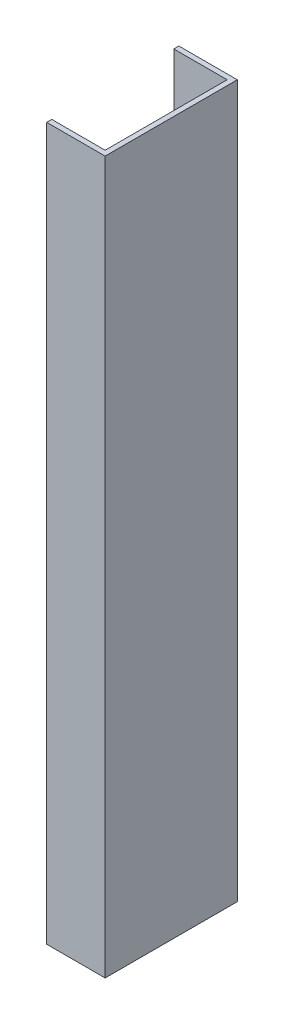
ISO-10303-21;
HEADER;
FILE_DESCRIPTION(('STEP AP214'),'2;1');
FILE_NAME('part.step','',(''),(''),'','','');
FILE_SCHEMA(('AUTOMOTIVE_DESIGN { 1 0 10303 214 1 1 1 1 }'));
ENDSEC;
DATA;
#1=APPLICATION_CONTEXT('core data for automotive mechanical design processes');
#2=APPLICATION_PROTOCOL_DEFINITION('international standard','automotive_design',2000,#1);
#3=PRODUCT_CONTEXT('',#1,'mechanical');
#4=PRODUCT('Part','Part','',(#3));
#5=PRODUCT_RELATED_PRODUCT_CATEGORY('part','',(#4));
#6=PRODUCT_DEFINITION_FORMATION('','',#4);
#7=PRODUCT_DEFINITION_CONTEXT('part definition',#1,'design');
#8=PRODUCT_DEFINITION('design','',#6,#7);
#9=PRODUCT_DEFINITION_SHAPE('','',#8);
#10=(LENGTH_UNIT() NAMED_UNIT(*) SI_UNIT(.MILLI.,.METRE.));
#11=(NAMED_UNIT(*) PLANE_ANGLE_UNIT() SI_UNIT($,.RADIAN.));
#12=(NAMED_UNIT(*) SI_UNIT($,.STERADIAN.) SOLID_ANGLE_UNIT());
#13=UNCERTAINTY_MEASURE_WITH_UNIT(LENGTH_MEASURE(1.E-05),#10,'distance_accuracy_value','');
#14=(GEOMETRIC_REPRESENTATION_CONTEXT(3) GLOBAL_UNCERTAINTY_ASSIGNED_CONTEXT((#13)) GLOBAL_UNIT_ASSIGNED_CONTEXT((#10,
#11,#12)) REPRESENTATION_CONTEXT('',''));
#15=CARTESIAN_POINT('',(0.,0.,0.));
#16=DIRECTION('',(0.,0.,1.));
#17=DIRECTION('',(1.,0.,0.));
#18=AXIS2_PLACEMENT_3D('',#15,#16,#17);
#19=CARTESIAN_POINT('',(-36.5125,222.25,38.1));
#20=DIRECTION('',(0.,0.,1.));
#21=DIRECTION('',(1.,0.,0.));
#22=AXIS2_PLACEMENT_3D('',#19,#20,#21);
#23=PLANE('',#22);
#24=DIRECTION('',(-1.,0.,0.));
#25=VECTOR('',#24,1.);
#26=CARTESIAN_POINT('',(-36.5125,-222.25,38.1));
#27=LINE('',#26,#25);
#28=CARTESIAN_POINT('',(-3.17499999999999,-222.25,38.1));
#29=VERTEX_POINT('',#28);
#30=CARTESIAN_POINT('',(-36.5125,-222.25,38.1));
#31=VERTEX_POINT('',#30);
#32=EDGE_CURVE('E144',#29,#31,#27,.T.);
#33=ORIENTED_EDGE('',*,*,#32,.T.);
#34=DIRECTION('',(0.,-1.,0.));
#35=VECTOR('',#34,1.);
#36=CARTESIAN_POINT('',(-36.5125,222.25,38.1));
#37=LINE('',#36,#35);
#38=CARTESIAN_POINT('',(-36.5125,222.25,38.1));
#39=VERTEX_POINT('',#38);
#40=EDGE_CURVE('E11',#39,#31,#37,.T.);
#41=ORIENTED_EDGE('',*,*,#40,.F.);
#42=DIRECTION('',(-1.,0.,0.));
#43=VECTOR('',#42,1.);
#44=CARTESIAN_POINT('',(-36.5125,222.25,38.1));
#45=LINE('',#44,#43);
#46=CARTESIAN_POINT('',(-3.17499999999999,222.25,38.1));
#47=VERTEX_POINT('',#46);
#48=EDGE_CURVE('E166',#47,#39,#45,.T.);
#49=ORIENTED_EDGE('',*,*,#48,.F.);
#50=DIRECTION('',(0.,-1.,0.));
#51=VECTOR('',#50,1.);
#52=CARTESIAN_POINT('',(-3.17499999999999,222.25,38.1));
#53=LINE('',#52,#51);
#54=EDGE_CURVE('E140',#47,#29,#53,.T.);
#55=ORIENTED_EDGE('',*,*,#54,.T.);
#56=EDGE_LOOP('',(#33,#41,#49,#55));
#57=FACE_BOUND('',#56,.T.);
#58=ADVANCED_FACE('F43',(#57),#23,.F.);
#59=CARTESIAN_POINT('',(-36.5125,222.25,41.275));
#60=DIRECTION('',(1.,0.,0.));
#61=DIRECTION('',(0.,0.,-1.));
#62=AXIS2_PLACEMENT_3D('',#59,#60,#61);
#63=PLANE('',#62);
#64=DIRECTION('',(0.,0.,1.));
#65=VECTOR('',#64,1.);
#66=CARTESIAN_POINT('',(-36.5125,-222.25,41.275));
#67=LINE('',#66,#65);
#68=CARTESIAN_POINT('',(-36.5125,-222.25,41.275));
#69=VERTEX_POINT('',#68);
#70=EDGE_CURVE('E148',#31,#69,#67,.T.);
#71=ORIENTED_EDGE('',*,*,#70,.T.);
#72=DIRECTION('',(0.,-1.,0.));
#73=VECTOR('',#72,1.);
#74=CARTESIAN_POINT('',(-36.5125,222.25,41.275));
#75=LINE('',#74,#73);
#76=CARTESIAN_POINT('',(-36.5125,222.25,41.275));
#77=VERTEX_POINT('',#76);
#78=EDGE_CURVE('E52',#77,#69,#75,.T.);
#79=ORIENTED_EDGE('',*,*,#78,.F.);
#80=DIRECTION('',(0.,0.,1.));
#81=VECTOR('',#80,1.);
#82=CARTESIAN_POINT('',(-36.5125,222.25,41.275));
#83=LINE('',#82,#81);
#84=EDGE_CURVE('E103',#39,#77,#83,.T.);
#85=ORIENTED_EDGE('',*,*,#84,.F.);
#86=ORIENTED_EDGE('',*,*,#40,.T.);
#87=EDGE_LOOP('',(#71,#79,#85,#86));
#88=FACE_BOUND('',#87,.T.);
#89=ADVANCED_FACE('F212',(#88),#63,.F.);
#90=CARTESIAN_POINT('',(0.,222.25,41.275));
#91=DIRECTION('',(0.,0.,-1.));
#92=DIRECTION('',(-1.,0.,0.));
#93=AXIS2_PLACEMENT_3D('',#90,#91,#92);
#94=PLANE('',#93);
#95=DIRECTION('',(1.,0.,0.));
#96=VECTOR('',#95,1.);
#97=CARTESIAN_POINT('',(0.,-222.25,41.275));
#98=LINE('',#97,#96);
#99=CARTESIAN_POINT('',(0.,-222.25,41.275));
#100=VERTEX_POINT('',#99);
#101=EDGE_CURVE('E151',#69,#100,#98,.T.);
#102=ORIENTED_EDGE('',*,*,#101,.T.);
#103=DIRECTION('',(0.,-1.,0.));
#104=VECTOR('',#103,1.);
#105=CARTESIAN_POINT('',(0.,222.25,41.275));
#106=LINE('',#105,#104);
#107=CARTESIAN_POINT('',(0.,222.25,41.275));
#108=VERTEX_POINT('',#107);
#109=EDGE_CURVE('E177',#108,#100,#106,.T.);
#110=ORIENTED_EDGE('',*,*,#109,.F.);
#111=DIRECTION('',(1.,0.,0.));
#112=VECTOR('',#111,1.);
#113=CARTESIAN_POINT('',(0.,222.25,41.275));
#114=LINE('',#113,#112);
#115=EDGE_CURVE('E187',#77,#108,#114,.T.);
#116=ORIENTED_EDGE('',*,*,#115,.F.);
#117=ORIENTED_EDGE('',*,*,#78,.T.);
#118=EDGE_LOOP('',(#102,#110,#116,#117));
#119=FACE_BOUND('',#118,.T.);
#120=ADVANCED_FACE('F185',(#119),#94,.F.);
#121=CARTESIAN_POINT('',(0.,222.25,-41.275));
#122=DIRECTION('',(-1.,0.,0.));
#123=DIRECTION('',(0.,0.,1.));
#124=AXIS2_PLACEMENT_3D('',#121,#122,#123);
#125=PLANE('',#124);
#126=DIRECTION('',(0.,0.,-1.));
#127=VECTOR('',#126,1.);
#128=CARTESIAN_POINT('',(0.,-222.25,-41.275));
#129=LINE('',#128,#127);
#130=CARTESIAN_POINT('',(0.,-222.25,-41.275));
#131=VERTEX_POINT('',#130);
#132=EDGE_CURVE('E154',#100,#131,#129,.T.);
#133=ORIENTED_EDGE('',*,*,#132,.T.);
#134=DIRECTION('',(0.,-1.,0.));
#135=VECTOR('',#134,1.);
#136=CARTESIAN_POINT('',(0.,222.25,-41.275));
#137=LINE('',#136,#135);
#138=CARTESIAN_POINT('',(0.,222.25,-41.275));
#139=VERTEX_POINT('',#138);
#140=EDGE_CURVE('E173',#139,#131,#137,.T.);
#141=ORIENTED_EDGE('',*,*,#140,.F.);
#142=DIRECTION('',(0.,0.,-1.));
#143=VECTOR('',#142,1.);
#144=CARTESIAN_POINT('',(0.,222.25,-41.275));
#145=LINE('',#144,#143);
#146=EDGE_CURVE('E200',#108,#139,#145,.T.);
#147=ORIENTED_EDGE('',*,*,#146,.F.);
#148=ORIENTED_EDGE('',*,*,#109,.T.);
#149=EDGE_LOOP('',(#133,#141,#147,#148));
#150=FACE_BOUND('',#149,.T.);
#151=ADVANCED_FACE('F195',(#150),#125,.F.);
#152=CARTESIAN_POINT('',(0.,222.25,-41.275));
#153=DIRECTION('',(0.,0.,1.));
#154=DIRECTION('',(1.,0.,0.));
#155=AXIS2_PLACEMENT_3D('',#152,#153,#154);
#156=PLANE('',#155);
#157=DIRECTION('',(-1.,0.,0.));
#158=VECTOR('',#157,1.);
#159=CARTESIAN_POINT('',(0.,-222.25,-41.275));
#160=LINE('',#159,#158);
#161=CARTESIAN_POINT('',(-36.5125,-222.25,-41.275));
#162=VERTEX_POINT('',#161);
#163=EDGE_CURVE('E157',#131,#162,#160,.T.);
#164=ORIENTED_EDGE('',*,*,#163,.T.);
#165=DIRECTION('',(0.,-1.,0.));
#166=VECTOR('',#165,1.);
#167=CARTESIAN_POINT('',(-36.5125,222.25,-41.275));
#168=LINE('',#167,#166);
#169=CARTESIAN_POINT('',(-36.5125,222.25,-41.275));
#170=VERTEX_POINT('',#169);
#171=EDGE_CURVE('E133',#170,#162,#168,.T.);
#172=ORIENTED_EDGE('',*,*,#171,.F.);
#173=DIRECTION('',(-1.,0.,0.));
#174=VECTOR('',#173,1.);
#175=CARTESIAN_POINT('',(0.,222.25,-41.275));
#176=LINE('',#175,#174);
#177=EDGE_CURVE('E122',#139,#170,#176,.T.);
#178=ORIENTED_EDGE('',*,*,#177,.F.);
#179=ORIENTED_EDGE('',*,*,#140,.T.);
#180=EDGE_LOOP('',(#164,#172,#178,#179));
#181=FACE_BOUND('',#180,.T.);
#182=ADVANCED_FACE('F198',(#181),#156,.F.);
#183=CARTESIAN_POINT('',(-36.5125,222.25,-38.1));
#184=DIRECTION('',(1.,0.,0.));
#185=DIRECTION('',(0.,0.,-1.));
#186=AXIS2_PLACEMENT_3D('',#183,#184,#185);
#187=PLANE('',#186);
#188=DIRECTION('',(0.,0.,1.));
#189=VECTOR('',#188,1.);
#190=CARTESIAN_POINT('',(-36.5125,-222.25,-38.1));
#191=LINE('',#190,#189);
#192=CARTESIAN_POINT('',(-36.5125,-222.25,-38.1));
#193=VERTEX_POINT('',#192);
#194=EDGE_CURVE('E131',#162,#193,#191,.T.);
#195=ORIENTED_EDGE('',*,*,#194,.T.);
#196=DIRECTION('',(0.,-1.,0.));
#197=VECTOR('',#196,1.);
#198=CARTESIAN_POINT('',(-36.5125,222.25,-38.1));
#199=LINE('',#198,#197);
#200=CARTESIAN_POINT('',(-36.5125,222.25,-38.1));
#201=VERTEX_POINT('',#200);
#202=EDGE_CURVE('E128',#201,#193,#199,.T.);
#203=ORIENTED_EDGE('',*,*,#202,.F.);
#204=DIRECTION('',(0.,0.,1.));
#205=VECTOR('',#204,1.);
#206=CARTESIAN_POINT('',(-36.5125,222.25,-38.1));
#207=LINE('',#206,#205);
#208=EDGE_CURVE('E116',#170,#201,#207,.T.);
#209=ORIENTED_EDGE('',*,*,#208,.F.);
#210=ORIENTED_EDGE('',*,*,#171,.T.);
#211=EDGE_LOOP('',(#195,#203,#209,#210));
#212=FACE_BOUND('',#211,.T.);
#213=ADVANCED_FACE('F129',(#212),#187,.F.);
#214=CARTESIAN_POINT('',(-3.17499999999999,222.25,-38.1));
#215=DIRECTION('',(0.,0.,-1.));
#216=DIRECTION('',(-1.,0.,0.));
#217=AXIS2_PLACEMENT_3D('',#214,#215,#216);
#218=PLANE('',#217);
#219=DIRECTION('',(1.,0.,0.));
#220=VECTOR('',#219,1.);
#221=CARTESIAN_POINT('',(-3.17499999999999,-222.25,-38.1));
#222=LINE('',#221,#220);
#223=CARTESIAN_POINT('',(-3.17499999999999,-222.25,-38.1));
#224=VERTEX_POINT('',#223);
#225=EDGE_CURVE('E89',#193,#224,#222,.T.);
#226=ORIENTED_EDGE('',*,*,#225,.T.);
#227=DIRECTION('',(0.,-1.,0.));
#228=VECTOR('',#227,1.);
#229=CARTESIAN_POINT('',(-3.17499999999999,222.25,-38.1));
#230=LINE('',#229,#228);
#231=CARTESIAN_POINT('',(-3.17499999999999,222.25,-38.1));
#232=VERTEX_POINT('',#231);
#233=EDGE_CURVE('E134',#232,#224,#230,.T.);
#234=ORIENTED_EDGE('',*,*,#233,.F.);
#235=DIRECTION('',(1.,0.,0.));
#236=VECTOR('',#235,1.);
#237=CARTESIAN_POINT('',(-3.17499999999999,222.25,-38.1));
#238=LINE('',#237,#236);
#239=EDGE_CURVE('E120',#201,#232,#238,.T.);
#240=ORIENTED_EDGE('',*,*,#239,.F.);
#241=ORIENTED_EDGE('',*,*,#202,.T.);
#242=EDGE_LOOP('',(#226,#234,#240,#241));
#243=FACE_BOUND('',#242,.T.);
#244=ADVANCED_FACE('F136',(#243),#218,.F.);
#245=CARTESIAN_POINT('',(-3.17499999999999,222.25,38.1));
#246=DIRECTION('',(1.,0.,0.));
#247=DIRECTION('',(0.,0.,-1.));
#248=AXIS2_PLACEMENT_3D('',#245,#246,#247);
#249=PLANE('',#248);
#250=DIRECTION('',(0.,0.,1.));
#251=VECTOR('',#250,1.);
#252=CARTESIAN_POINT('',(-3.17499999999999,-222.25,38.1));
#253=LINE('',#252,#251);
#254=EDGE_CURVE('E95',#224,#29,#253,.T.);
#255=ORIENTED_EDGE('',*,*,#254,.T.);
#256=ORIENTED_EDGE('',*,*,#54,.F.);
#257=DIRECTION('',(0.,0.,1.));
#258=VECTOR('',#257,1.);
#259=CARTESIAN_POINT('',(-3.17499999999999,222.25,38.1));
#260=LINE('',#259,#258);
#261=EDGE_CURVE('E60',#232,#47,#260,.T.);
#262=ORIENTED_EDGE('',*,*,#261,.F.);
#263=ORIENTED_EDGE('',*,*,#233,.T.);
#264=EDGE_LOOP('',(#255,#256,#262,#263));
#265=FACE_BOUND('',#264,.T.);
#266=ADVANCED_FACE('F228',(#265),#249,.F.);
#267=CARTESIAN_POINT('',(0.,222.25,0.));
#268=DIRECTION('',(0.,1.,0.));
#269=DIRECTION('',(0.,0.,1.));
#270=AXIS2_PLACEMENT_3D('',#267,#268,#269);
#271=PLANE('',#270);
#272=ORIENTED_EDGE('',*,*,#48,.T.);
#273=ORIENTED_EDGE('',*,*,#84,.T.);
#274=ORIENTED_EDGE('',*,*,#115,.T.);
#275=ORIENTED_EDGE('',*,*,#146,.T.);
#276=ORIENTED_EDGE('',*,*,#177,.T.);
#277=ORIENTED_EDGE('',*,*,#208,.T.);
#278=ORIENTED_EDGE('',*,*,#239,.T.);
#279=ORIENTED_EDGE('',*,*,#261,.T.);
#280=EDGE_LOOP('',(#272,#273,#274,#275,#276,#277,#278,#279));
#281=FACE_BOUND('',#280,.T.);
#282=ADVANCED_FACE('F118',(#281),#271,.T.);
#283=CARTESIAN_POINT('',(0.,-222.25,0.));
#284=DIRECTION('',(0.,1.,0.));
#285=DIRECTION('',(0.,0.,1.));
#286=AXIS2_PLACEMENT_3D('',#283,#284,#285);
#287=PLANE('',#286);
#288=ORIENTED_EDGE('',*,*,#32,.F.);
#289=ORIENTED_EDGE('',*,*,#254,.F.);
#290=ORIENTED_EDGE('',*,*,#225,.F.);
#291=ORIENTED_EDGE('',*,*,#194,.F.);
#292=ORIENTED_EDGE('',*,*,#163,.F.);
#293=ORIENTED_EDGE('',*,*,#132,.F.);
#294=ORIENTED_EDGE('',*,*,#101,.F.);
#295=ORIENTED_EDGE('',*,*,#70,.F.);
#296=EDGE_LOOP('',(#288,#289,#290,#291,#292,#293,#294,#295));
#297=FACE_BOUND('',#296,.T.);
#298=ADVANCED_FACE('F191',(#297),#287,.F.);
#299=CLOSED_SHELL('',(#58,#89,#120,#151,#182,#213,#244,#266,#282,#298));
#300=MANIFOLD_SOLID_BREP('B2',#299);
#301=ADVANCED_BREP_SHAPE_REPRESENTATION('',(#18,#300),#14);
#302=SHAPE_DEFINITION_REPRESENTATION(#9,#301);
ENDSEC;
END-ISO-10303-21;
